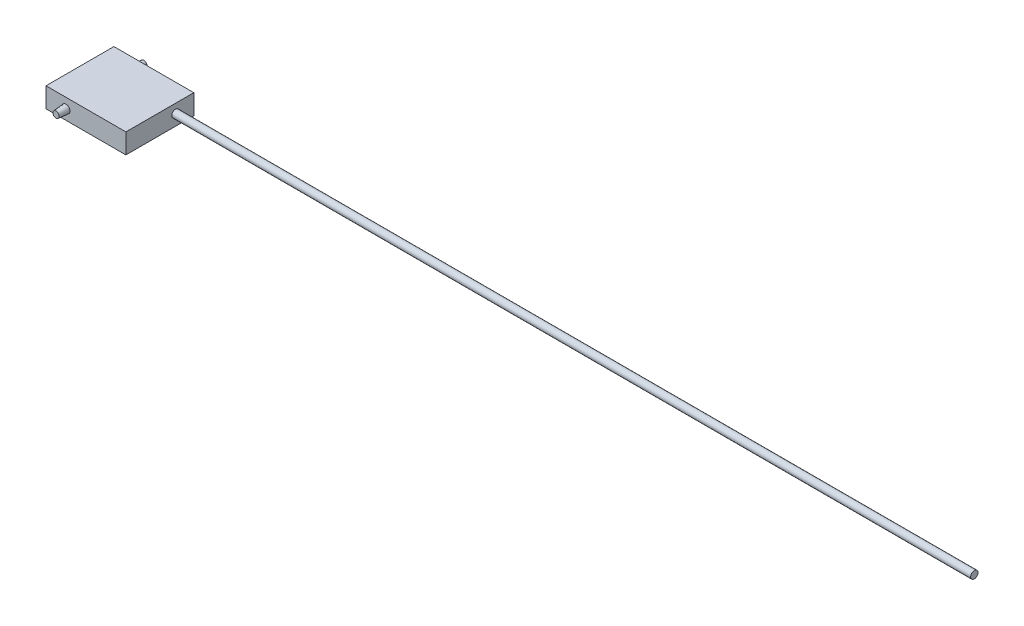
ISO-10303-21;
HEADER;
FILE_DESCRIPTION(('STEP AP214'),'2;1');
FILE_NAME('part.step','',(''),(''),'','','');
FILE_SCHEMA(('AUTOMOTIVE_DESIGN { 1 0 10303 214 1 1 1 1 }'));
ENDSEC;
DATA;
#1=APPLICATION_CONTEXT('core data for automotive mechanical design processes');
#2=APPLICATION_PROTOCOL_DEFINITION('international standard','automotive_design',2000,#1);
#3=PRODUCT_CONTEXT('',#1,'mechanical');
#4=PRODUCT('Part','Part','',(#3));
#5=PRODUCT_RELATED_PRODUCT_CATEGORY('part','',(#4));
#6=PRODUCT_DEFINITION_FORMATION('','',#4);
#7=PRODUCT_DEFINITION_CONTEXT('part definition',#1,'design');
#8=PRODUCT_DEFINITION('design','',#6,#7);
#9=PRODUCT_DEFINITION_SHAPE('','',#8);
#10=(LENGTH_UNIT() NAMED_UNIT(*) SI_UNIT(.MILLI.,.METRE.));
#11=(NAMED_UNIT(*) PLANE_ANGLE_UNIT() SI_UNIT($,.RADIAN.));
#12=(NAMED_UNIT(*) SI_UNIT($,.STERADIAN.) SOLID_ANGLE_UNIT());
#13=UNCERTAINTY_MEASURE_WITH_UNIT(LENGTH_MEASURE(1.E-05),#10,'distance_accuracy_value','');
#14=(GEOMETRIC_REPRESENTATION_CONTEXT(3) GLOBAL_UNCERTAINTY_ASSIGNED_CONTEXT((#13)) GLOBAL_UNIT_ASSIGNED_CONTEXT((#10,
#11,#12)) REPRESENTATION_CONTEXT('',''));
#15=CARTESIAN_POINT('',(0.,0.,0.));
#16=DIRECTION('',(0.,0.,1.));
#17=DIRECTION('',(1.,0.,0.));
#18=AXIS2_PLACEMENT_3D('',#15,#16,#17);
#19=CARTESIAN_POINT('',(12.7,6.35,10.795));
#20=DIRECTION('',(-1.,0.,0.));
#21=DIRECTION('',(0.,0.,1.));
#22=AXIS2_PLACEMENT_3D('',#19,#20,#21);
#23=PLANE('',#22);
#24=CARTESIAN_POINT('',(12.7,3.54999999999917,-4.95638753255173));
#25=DIRECTION('',(-1.,0.,0.));
#26=DIRECTION('',(0.,0.,1.));
#27=AXIS2_PLACEMENT_3D('',#24,#25,#26);
#28=CIRCLE('',#27,1.16904573914205);
#29=CARTESIAN_POINT('',(12.7,3.54999999999917,-3.78734179340968));
#30=VERTEX_POINT('',#29);
#31=EDGE_CURVE('E11',#30,#30,#28,.F.);
#32=ORIENTED_EDGE('',*,*,#31,.F.);
#33=EDGE_LOOP('',(#32));
#34=FACE_BOUND('',#33,.T.);
#35=DIRECTION('',(0.,0.,-1.));
#36=VECTOR('',#35,1.);
#37=CARTESIAN_POINT('',(12.7,0.,10.795));
#38=LINE('',#37,#36);
#39=CARTESIAN_POINT('',(12.7,0.,10.795));
#40=VERTEX_POINT('',#39);
#41=CARTESIAN_POINT('',(12.7,0.,-10.795));
#42=VERTEX_POINT('',#41);
#43=EDGE_CURVE('E101',#40,#42,#38,.T.);
#44=ORIENTED_EDGE('',*,*,#43,.T.);
#45=DIRECTION('',(0.,-1.,0.));
#46=VECTOR('',#45,1.);
#47=CARTESIAN_POINT('',(12.7,6.35,-10.795));
#48=LINE('',#47,#46);
#49=CARTESIAN_POINT('',(12.7,6.35,-10.795));
#50=VERTEX_POINT('',#49);
#51=EDGE_CURVE('E92',#50,#42,#48,.T.);
#52=ORIENTED_EDGE('',*,*,#51,.F.);
#53=DIRECTION('',(0.,0.,-1.));
#54=VECTOR('',#53,1.);
#55=CARTESIAN_POINT('',(12.7,6.35,10.795));
#56=LINE('',#55,#54);
#57=CARTESIAN_POINT('',(12.7,6.35,10.795));
#58=VERTEX_POINT('',#57);
#59=EDGE_CURVE('E86',#58,#50,#56,.T.);
#60=ORIENTED_EDGE('',*,*,#59,.F.);
#61=DIRECTION('',(0.,-1.,0.));
#62=VECTOR('',#61,1.);
#63=CARTESIAN_POINT('',(12.7,6.35,10.795));
#64=LINE('',#63,#62);
#65=EDGE_CURVE('E97',#58,#40,#64,.T.);
#66=ORIENTED_EDGE('',*,*,#65,.T.);
#67=EDGE_LOOP('',(#44,#52,#60,#66));
#68=FACE_BOUND('',#67,.T.);
#69=ADVANCED_FACE('F34',(#34,#68),#23,.F.);
#70=CARTESIAN_POINT('',(-12.7,6.35,-10.795));
#71=DIRECTION('',(0.,0.,1.));
#72=DIRECTION('',(1.,0.,0.));
#73=AXIS2_PLACEMENT_3D('',#70,#71,#72);
#74=PLANE('',#73);
#75=CARTESIAN_POINT('',(-6.35,3.175,-10.795));
#76=DIRECTION('',(0.,0.,1.));
#77=DIRECTION('',(1.,0.,0.));
#78=AXIS2_PLACEMENT_3D('',#75,#76,#77);
#79=CIRCLE('',#78,1.27);
#80=CARTESIAN_POINT('',(-5.08,3.175,-10.795));
#81=VERTEX_POINT('',#80);
#82=EDGE_CURVE('E167',#81,#81,#79,.T.);
#83=ORIENTED_EDGE('',*,*,#82,.T.);
#84=EDGE_LOOP('',(#83));
#85=FACE_BOUND('',#84,.T.);
#86=DIRECTION('',(-1.,0.,0.));
#87=VECTOR('',#86,1.);
#88=CARTESIAN_POINT('',(-12.7,0.,-10.795));
#89=LINE('',#88,#87);
#90=CARTESIAN_POINT('',(-12.7,0.,-10.795));
#91=VERTEX_POINT('',#90);
#92=EDGE_CURVE('E91',#42,#91,#89,.T.);
#93=ORIENTED_EDGE('',*,*,#92,.T.);
#94=DIRECTION('',(0.,-1.,0.));
#95=VECTOR('',#94,1.);
#96=CARTESIAN_POINT('',(-12.7,6.35,-10.795));
#97=LINE('',#96,#95);
#98=CARTESIAN_POINT('',(-12.7,6.35,-10.795));
#99=VERTEX_POINT('',#98);
#100=EDGE_CURVE('E89',#99,#91,#97,.T.);
#101=ORIENTED_EDGE('',*,*,#100,.F.);
#102=DIRECTION('',(-1.,0.,0.));
#103=VECTOR('',#102,1.);
#104=CARTESIAN_POINT('',(-12.7,6.35,-10.795));
#105=LINE('',#104,#103);
#106=EDGE_CURVE('E81',#50,#99,#105,.T.);
#107=ORIENTED_EDGE('',*,*,#106,.F.);
#108=ORIENTED_EDGE('',*,*,#51,.T.);
#109=EDGE_LOOP('',(#93,#101,#107,#108));
#110=FACE_BOUND('',#109,.T.);
#111=ADVANCED_FACE('F90',(#85,#110),#74,.F.);
#112=CARTESIAN_POINT('',(-12.7,6.35,10.795));
#113=DIRECTION('',(1.,0.,0.));
#114=DIRECTION('',(0.,0.,-1.));
#115=AXIS2_PLACEMENT_3D('',#112,#113,#114);
#116=PLANE('',#115);
#117=DIRECTION('',(0.,0.,1.));
#118=VECTOR('',#117,1.);
#119=CARTESIAN_POINT('',(-12.7,0.,10.795));
#120=LINE('',#119,#118);
#121=CARTESIAN_POINT('',(-12.7,0.,10.795));
#122=VERTEX_POINT('',#121);
#123=EDGE_CURVE('E67',#91,#122,#120,.T.);
#124=ORIENTED_EDGE('',*,*,#123,.T.);
#125=DIRECTION('',(0.,-1.,0.));
#126=VECTOR('',#125,1.);
#127=CARTESIAN_POINT('',(-12.7,6.35,10.795));
#128=LINE('',#127,#126);
#129=CARTESIAN_POINT('',(-12.7,6.35,10.795));
#130=VERTEX_POINT('',#129);
#131=EDGE_CURVE('E93',#130,#122,#128,.T.);
#132=ORIENTED_EDGE('',*,*,#131,.F.);
#133=DIRECTION('',(0.,0.,1.));
#134=VECTOR('',#133,1.);
#135=CARTESIAN_POINT('',(-12.7,6.35,10.795));
#136=LINE('',#135,#134);
#137=EDGE_CURVE('E84',#99,#130,#136,.T.);
#138=ORIENTED_EDGE('',*,*,#137,.F.);
#139=ORIENTED_EDGE('',*,*,#100,.T.);
#140=EDGE_LOOP('',(#124,#132,#138,#139));
#141=FACE_BOUND('',#140,.T.);
#142=ADVANCED_FACE('F95',(#141),#116,.F.);
#143=CARTESIAN_POINT('',(-12.7,6.35,10.795));
#144=DIRECTION('',(0.,0.,-1.));
#145=DIRECTION('',(-1.,0.,0.));
#146=AXIS2_PLACEMENT_3D('',#143,#144,#145);
#147=PLANE('',#146);
#148=CARTESIAN_POINT('',(-6.35,3.175,10.795));
#149=DIRECTION('',(0.,0.,-1.));
#150=DIRECTION('',(-1.,0.,0.));
#151=AXIS2_PLACEMENT_3D('',#148,#149,#150);
#152=CIRCLE('',#151,1.27);
#153=CARTESIAN_POINT('',(-7.62,3.175,10.795));
#154=VERTEX_POINT('',#153);
#155=EDGE_CURVE('E42',#154,#154,#152,.F.);
#156=ORIENTED_EDGE('',*,*,#155,.F.);
#157=EDGE_LOOP('',(#156));
#158=FACE_BOUND('',#157,.T.);
#159=DIRECTION('',(1.,0.,0.));
#160=VECTOR('',#159,1.);
#161=CARTESIAN_POINT('',(-12.7,0.,10.795));
#162=LINE('',#161,#160);
#163=EDGE_CURVE('E73',#122,#40,#162,.T.);
#164=ORIENTED_EDGE('',*,*,#163,.T.);
#165=ORIENTED_EDGE('',*,*,#65,.F.);
#166=DIRECTION('',(1.,0.,0.));
#167=VECTOR('',#166,1.);
#168=CARTESIAN_POINT('',(-12.7,6.35,10.795));
#169=LINE('',#168,#167);
#170=EDGE_CURVE('E50',#130,#58,#169,.T.);
#171=ORIENTED_EDGE('',*,*,#170,.F.);
#172=ORIENTED_EDGE('',*,*,#131,.T.);
#173=EDGE_LOOP('',(#164,#165,#171,#172));
#174=FACE_BOUND('',#173,.T.);
#175=ADVANCED_FACE('F115',(#158,#174),#147,.F.);
#176=CARTESIAN_POINT('',(0.,6.35,0.));
#177=DIRECTION('',(0.,-1.,0.));
#178=DIRECTION('',(0.,0.,-1.));
#179=AXIS2_PLACEMENT_3D('',#176,#177,#178);
#180=PLANE('',#179);
#181=ORIENTED_EDGE('',*,*,#59,.T.);
#182=ORIENTED_EDGE('',*,*,#106,.T.);
#183=ORIENTED_EDGE('',*,*,#137,.T.);
#184=ORIENTED_EDGE('',*,*,#170,.T.);
#185=EDGE_LOOP('',(#181,#182,#183,#184));
#186=FACE_BOUND('',#185,.T.);
#187=ADVANCED_FACE('F82',(#186),#180,.F.);
#188=CARTESIAN_POINT('',(0.,0.,0.));
#189=DIRECTION('',(0.,-1.,0.));
#190=DIRECTION('',(0.,0.,-1.));
#191=AXIS2_PLACEMENT_3D('',#188,#189,#190);
#192=PLANE('',#191);
#193=ORIENTED_EDGE('',*,*,#43,.F.);
#194=ORIENTED_EDGE('',*,*,#163,.F.);
#195=ORIENTED_EDGE('',*,*,#123,.F.);
#196=ORIENTED_EDGE('',*,*,#92,.F.);
#197=EDGE_LOOP('',(#193,#194,#195,#196));
#198=FACE_BOUND('',#197,.T.);
#199=ADVANCED_FACE('F122',(#198),#192,.T.);
#200=CARTESIAN_POINT('',(-6.35,3.175,10.795));
#201=DIRECTION('',(0.,0.,-1.));
#202=DIRECTION('',(1.,0.,0.));
#203=AXIS2_PLACEMENT_3D('',#200,#201,#202);
#204=CONICAL_SURFACE('',#203,1.27,0.0872664625997167);
#205=CARTESIAN_POINT('',(-6.35,3.175,13.97));
#206=DIRECTION('',(0.,0.,1.));
#207=DIRECTION('',(1.,0.,0.));
#208=AXIS2_PLACEMENT_3D('',#205,#206,#207);
#209=CIRCLE('',#208,0.992223493305191);
#210=CARTESIAN_POINT('',(-5.35777650669481,3.175,13.97));
#211=VERTEX_POINT('',#210);
#212=EDGE_CURVE('E104',#211,#211,#209,.T.);
#213=ORIENTED_EDGE('',*,*,#212,.F.);
#214=EDGE_LOOP('',(#213));
#215=FACE_BOUND('',#214,.T.);
#216=ORIENTED_EDGE('',*,*,#155,.T.);
#217=EDGE_LOOP('',(#216));
#218=FACE_BOUND('',#217,.T.);
#219=ADVANCED_FACE('F113',(#215,#218),#204,.T.);
#220=CARTESIAN_POINT('',(-6.35,3.175,13.97));
#221=DIRECTION('',(0.,0.,1.));
#222=DIRECTION('',(1.,0.,0.));
#223=AXIS2_PLACEMENT_3D('',#220,#221,#222);
#224=PLANE('',#223);
#225=ORIENTED_EDGE('',*,*,#212,.T.);
#226=EDGE_LOOP('',(#225));
#227=FACE_BOUND('',#226,.T.);
#228=ADVANCED_FACE('F140',(#227),#224,.T.);
#229=CARTESIAN_POINT('',(-6.35,3.175,-10.795));
#230=DIRECTION('',(0.,0.,1.));
#231=DIRECTION('',(1.,0.,0.));
#232=AXIS2_PLACEMENT_3D('',#229,#230,#231);
#233=CONICAL_SURFACE('',#232,1.27,0.0872664625997167);
#234=CARTESIAN_POINT('',(-6.35,3.175,-13.97));
#235=DIRECTION('',(0.,0.,-1.));
#236=DIRECTION('',(-1.,0.,0.));
#237=AXIS2_PLACEMENT_3D('',#234,#235,#236);
#238=CIRCLE('',#237,0.992223493305191);
#239=CARTESIAN_POINT('',(-7.34222349330519,3.175,-13.97));
#240=VERTEX_POINT('',#239);
#241=EDGE_CURVE('E170',#240,#240,#238,.F.);
#242=ORIENTED_EDGE('',*,*,#241,.T.);
#243=EDGE_LOOP('',(#242));
#244=FACE_BOUND('',#243,.T.);
#245=ORIENTED_EDGE('',*,*,#82,.F.);
#246=EDGE_LOOP('',(#245));
#247=FACE_BOUND('',#246,.T.);
#248=ADVANCED_FACE('F146',(#244,#247),#233,.T.);
#249=CARTESIAN_POINT('',(-6.35,3.175,-13.97));
#250=DIRECTION('',(0.,0.,-1.));
#251=DIRECTION('',(1.,0.,0.));
#252=AXIS2_PLACEMENT_3D('',#249,#250,#251);
#253=PLANE('',#252);
#254=ORIENTED_EDGE('',*,*,#241,.F.);
#255=EDGE_LOOP('',(#254));
#256=FACE_BOUND('',#255,.T.);
#257=ADVANCED_FACE('F150',(#256),#253,.T.);
#258=CARTESIAN_POINT('',(266.7,3.54999999999917,-4.95638753255173));
#259=DIRECTION('',(-1.,0.,0.));
#260=DIRECTION('',(0.,0.,1.));
#261=AXIS2_PLACEMENT_3D('',#258,#259,#260);
#262=CYLINDRICAL_SURFACE('',#261,1.16904573914205);
#263=CARTESIAN_POINT('',(266.7,3.54999999999917,-4.95638753255173));
#264=DIRECTION('',(1.,0.,0.));
#265=DIRECTION('',(0.,0.,-1.));
#266=AXIS2_PLACEMENT_3D('',#263,#264,#265);
#267=CIRCLE('',#266,1.16904573914205);
#268=CARTESIAN_POINT('',(266.7,3.54999999999917,-6.12543327169378));
#269=VERTEX_POINT('',#268);
#270=EDGE_CURVE('E166',#269,#269,#267,.T.);
#271=ORIENTED_EDGE('',*,*,#270,.F.);
#272=EDGE_LOOP('',(#271));
#273=FACE_BOUND('',#272,.T.);
#274=ORIENTED_EDGE('',*,*,#31,.T.);
#275=EDGE_LOOP('',(#274));
#276=FACE_BOUND('',#275,.T.);
#277=ADVANCED_FACE('F154',(#273,#276),#262,.T.);
#278=CARTESIAN_POINT('',(266.7,3.54999999999917,-4.95638753255173));
#279=DIRECTION('',(1.,0.,0.));
#280=DIRECTION('',(0.,0.,-1.));
#281=AXIS2_PLACEMENT_3D('',#278,#279,#280);
#282=PLANE('',#281);
#283=ORIENTED_EDGE('',*,*,#270,.T.);
#284=EDGE_LOOP('',(#283));
#285=FACE_BOUND('',#284,.T.);
#286=ADVANCED_FACE('F158',(#285),#282,.T.);
#287=CLOSED_SHELL('',(#69,#111,#142,#175,#187,#199,#219,#228,#248,#257,#277,#286));
#288=MANIFOLD_SOLID_BREP('B2',#287);
#289=ADVANCED_BREP_SHAPE_REPRESENTATION('',(#18,#288),#14);
#290=SHAPE_DEFINITION_REPRESENTATION(#9,#289);
ENDSEC;
END-ISO-10303-21;
